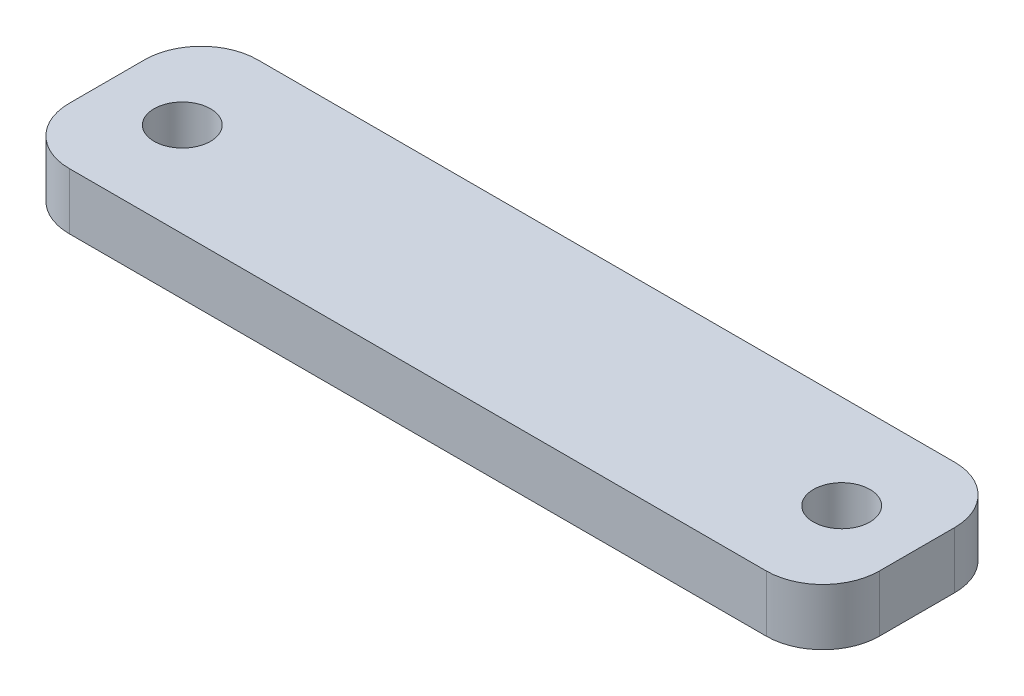
ISO-10303-21;
HEADER;
FILE_DESCRIPTION(('STEP AP214'),'2;1');
FILE_NAME('part.step','',(''),(''),'','','');
FILE_SCHEMA(('AUTOMOTIVE_DESIGN { 1 0 10303 214 1 1 1 1 }'));
ENDSEC;
DATA;
#1=APPLICATION_CONTEXT('core data for automotive mechanical design processes');
#2=APPLICATION_PROTOCOL_DEFINITION('international standard','automotive_design',2000,#1);
#3=PRODUCT_CONTEXT('',#1,'mechanical');
#4=PRODUCT('Part','Part','',(#3));
#5=PRODUCT_RELATED_PRODUCT_CATEGORY('part','',(#4));
#6=PRODUCT_DEFINITION_FORMATION('','',#4);
#7=PRODUCT_DEFINITION_CONTEXT('part definition',#1,'design');
#8=PRODUCT_DEFINITION('design','',#6,#7);
#9=PRODUCT_DEFINITION_SHAPE('','',#8);
#10=(LENGTH_UNIT() NAMED_UNIT(*) SI_UNIT(.MILLI.,.METRE.));
#11=(NAMED_UNIT(*) PLANE_ANGLE_UNIT() SI_UNIT($,.RADIAN.));
#12=(NAMED_UNIT(*) SI_UNIT($,.STERADIAN.) SOLID_ANGLE_UNIT());
#13=UNCERTAINTY_MEASURE_WITH_UNIT(LENGTH_MEASURE(1.E-05),#10,'distance_accuracy_value','');
#14=(GEOMETRIC_REPRESENTATION_CONTEXT(3) GLOBAL_UNCERTAINTY_ASSIGNED_CONTEXT((#13)) GLOBAL_UNIT_ASSIGNED_CONTEXT((#10,
#11,#12)) REPRESENTATION_CONTEXT('',''));
#15=CARTESIAN_POINT('',(0.,0.,0.));
#16=DIRECTION('',(0.,0.,1.));
#17=DIRECTION('',(1.,0.,0.));
#18=AXIS2_PLACEMENT_3D('',#15,#16,#17);
#19=CARTESIAN_POINT('',(0.,3.,0.));
#20=DIRECTION('',(0.,1.,0.));
#21=DIRECTION('',(0.,0.,1.));
#22=AXIS2_PLACEMENT_3D('',#19,#20,#21);
#23=PLANE('',#22);
#24=DIRECTION('',(0.,0.,1.));
#25=VECTOR('',#24,1.);
#26=CARTESIAN_POINT('',(-21.5,3.,-5.));
#27=LINE('',#26,#25);
#28=CARTESIAN_POINT('',(-21.5,3.,-2.));
#29=VERTEX_POINT('',#28);
#30=CARTESIAN_POINT('',(-21.5,3.,2.));
#31=VERTEX_POINT('',#30);
#32=EDGE_CURVE('E170',#29,#31,#27,.T.);
#33=ORIENTED_EDGE('',*,*,#32,.T.);
#34=CARTESIAN_POINT('',(-18.5,3.,2.));
#35=DIRECTION('',(0.,1.,0.));
#36=DIRECTION('',(0.,0.,1.));
#37=AXIS2_PLACEMENT_3D('',#34,#35,#36);
#38=CIRCLE('',#37,3.);
#39=CARTESIAN_POINT('',(-18.5,3.,5.));
#40=VERTEX_POINT('',#39);
#41=EDGE_CURVE('E147',#31,#40,#38,.T.);
#42=ORIENTED_EDGE('',*,*,#41,.T.);
#43=DIRECTION('',(1.,0.,0.));
#44=VECTOR('',#43,1.);
#45=CARTESIAN_POINT('',(-21.5,3.,5.));
#46=LINE('',#45,#44);
#47=CARTESIAN_POINT('',(18.5,3.,5.));
#48=VERTEX_POINT('',#47);
#49=EDGE_CURVE('E119',#40,#48,#46,.T.);
#50=ORIENTED_EDGE('',*,*,#49,.T.);
#51=CARTESIAN_POINT('',(18.5,3.,2.));
#52=DIRECTION('',(0.,1.,0.));
#53=DIRECTION('',(0.,0.,1.));
#54=AXIS2_PLACEMENT_3D('',#51,#52,#53);
#55=CIRCLE('',#54,3.);
#56=CARTESIAN_POINT('',(21.5,3.,2.));
#57=VERTEX_POINT('',#56);
#58=EDGE_CURVE('E143',#48,#57,#55,.T.);
#59=ORIENTED_EDGE('',*,*,#58,.T.);
#60=DIRECTION('',(0.,0.,-1.));
#61=VECTOR('',#60,1.);
#62=CARTESIAN_POINT('',(21.5,3.,-5.));
#63=LINE('',#62,#61);
#64=CARTESIAN_POINT('',(21.5,3.,-2.));
#65=VERTEX_POINT('',#64);
#66=EDGE_CURVE('E126',#57,#65,#63,.T.);
#67=ORIENTED_EDGE('',*,*,#66,.T.);
#68=CARTESIAN_POINT('',(18.5,3.,-2.));
#69=DIRECTION('',(0.,1.,0.));
#70=DIRECTION('',(0.,0.,1.));
#71=AXIS2_PLACEMENT_3D('',#68,#69,#70);
#72=CIRCLE('',#71,3.);
#73=CARTESIAN_POINT('',(18.5,3.,-5.));
#74=VERTEX_POINT('',#73);
#75=EDGE_CURVE('E54',#65,#74,#72,.T.);
#76=ORIENTED_EDGE('',*,*,#75,.T.);
#77=DIRECTION('',(-1.,0.,0.));
#78=VECTOR('',#77,1.);
#79=CARTESIAN_POINT('',(-21.5,3.,-5.));
#80=LINE('',#79,#78);
#81=CARTESIAN_POINT('',(-18.5,3.,-5.));
#82=VERTEX_POINT('',#81);
#83=EDGE_CURVE('E129',#74,#82,#80,.T.);
#84=ORIENTED_EDGE('',*,*,#83,.T.);
#85=CARTESIAN_POINT('',(-18.5,3.,-2.));
#86=DIRECTION('',(0.,1.,0.));
#87=DIRECTION('',(0.,0.,1.));
#88=AXIS2_PLACEMENT_3D('',#85,#86,#87);
#89=CIRCLE('',#88,3.);
#90=EDGE_CURVE('E145',#82,#29,#89,.T.);
#91=ORIENTED_EDGE('',*,*,#90,.T.);
#92=EDGE_LOOP('',(#33,#42,#50,#59,#67,#76,#84,#91));
#93=FACE_BOUND('',#92,.T.);
#94=CARTESIAN_POINT('',(-17.5,3.,0.));
#95=DIRECTION('',(0.,-1.,0.));
#96=DIRECTION('',(0.,0.,-1.));
#97=AXIS2_PLACEMENT_3D('',#94,#95,#96);
#98=CIRCLE('',#97,1.5);
#99=CARTESIAN_POINT('',(-17.5,3.,-1.5));
#100=VERTEX_POINT('',#99);
#101=EDGE_CURVE('E166',#100,#100,#98,.T.);
#102=ORIENTED_EDGE('',*,*,#101,.T.);
#103=EDGE_LOOP('',(#102));
#104=FACE_BOUND('',#103,.T.);
#105=CARTESIAN_POINT('',(17.5,3.,0.));
#106=DIRECTION('',(0.,-1.,0.));
#107=DIRECTION('',(0.,0.,-1.));
#108=AXIS2_PLACEMENT_3D('',#105,#106,#107);
#109=CIRCLE('',#108,1.5);
#110=CARTESIAN_POINT('',(17.5,3.,-1.49999999999999));
#111=VERTEX_POINT('',#110);
#112=EDGE_CURVE('E178',#111,#111,#109,.T.);
#113=ORIENTED_EDGE('',*,*,#112,.T.);
#114=EDGE_LOOP('',(#113));
#115=FACE_BOUND('',#114,.T.);
#116=ADVANCED_FACE('F32',(#93,#104,#115),#23,.T.);
#117=CARTESIAN_POINT('',(21.5,3.,-5.));
#118=DIRECTION('',(-1.,0.,0.));
#119=DIRECTION('',(0.,0.,1.));
#120=AXIS2_PLACEMENT_3D('',#117,#118,#119);
#121=PLANE('',#120);
#122=ORIENTED_EDGE('',*,*,#66,.F.);
#123=DIRECTION('',(0.,-1.,0.));
#124=VECTOR('',#123,1.);
#125=CARTESIAN_POINT('',(21.5,3.,2.));
#126=LINE('',#125,#124);
#127=CARTESIAN_POINT('',(21.5,0.,2.));
#128=VERTEX_POINT('',#127);
#129=EDGE_CURVE('E11',#57,#128,#126,.T.);
#130=ORIENTED_EDGE('',*,*,#129,.T.);
#131=DIRECTION('',(0.,0.,-1.));
#132=VECTOR('',#131,1.);
#133=CARTESIAN_POINT('',(21.5,0.,-5.));
#134=LINE('',#133,#132);
#135=CARTESIAN_POINT('',(21.5,0.,-2.));
#136=VERTEX_POINT('',#135);
#137=EDGE_CURVE('E158',#128,#136,#134,.T.);
#138=ORIENTED_EDGE('',*,*,#137,.T.);
#139=DIRECTION('',(0.,-1.,0.));
#140=VECTOR('',#139,1.);
#141=CARTESIAN_POINT('',(21.5,3.,-2.));
#142=LINE('',#141,#140);
#143=EDGE_CURVE('E40',#136,#65,#142,.F.);
#144=ORIENTED_EDGE('',*,*,#143,.T.);
#145=EDGE_LOOP('',(#122,#130,#138,#144));
#146=FACE_BOUND('',#145,.T.);
#147=ADVANCED_FACE('F156',(#146),#121,.F.);
#148=CARTESIAN_POINT('',(-21.5,3.,-5.));
#149=DIRECTION('',(0.,0.,1.));
#150=DIRECTION('',(1.,0.,0.));
#151=AXIS2_PLACEMENT_3D('',#148,#149,#150);
#152=PLANE('',#151);
#153=DIRECTION('',(-1.,0.,0.));
#154=VECTOR('',#153,1.);
#155=CARTESIAN_POINT('',(-21.5,0.,-5.));
#156=LINE('',#155,#154);
#157=CARTESIAN_POINT('',(18.5,0.,-5.));
#158=VERTEX_POINT('',#157);
#159=CARTESIAN_POINT('',(-18.5,0.,-5.));
#160=VERTEX_POINT('',#159);
#161=EDGE_CURVE('E131',#158,#160,#156,.T.);
#162=ORIENTED_EDGE('',*,*,#161,.T.);
#163=DIRECTION('',(0.,-1.,0.));
#164=VECTOR('',#163,1.);
#165=CARTESIAN_POINT('',(-18.5,3.,-5.));
#166=LINE('',#165,#164);
#167=EDGE_CURVE('E47',#160,#82,#166,.F.);
#168=ORIENTED_EDGE('',*,*,#167,.T.);
#169=ORIENTED_EDGE('',*,*,#83,.F.);
#170=DIRECTION('',(0.,-1.,0.));
#171=VECTOR('',#170,1.);
#172=CARTESIAN_POINT('',(18.5,3.,-5.));
#173=LINE('',#172,#171);
#174=EDGE_CURVE('E149',#74,#158,#173,.T.);
#175=ORIENTED_EDGE('',*,*,#174,.T.);
#176=EDGE_LOOP('',(#162,#168,#169,#175));
#177=FACE_BOUND('',#176,.T.);
#178=ADVANCED_FACE('F165',(#177),#152,.F.);
#179=CARTESIAN_POINT('',(-21.5,3.,-5.));
#180=DIRECTION('',(1.,0.,0.));
#181=DIRECTION('',(0.,0.,-1.));
#182=AXIS2_PLACEMENT_3D('',#179,#180,#181);
#183=PLANE('',#182);
#184=DIRECTION('',(0.,0.,1.));
#185=VECTOR('',#184,1.);
#186=CARTESIAN_POINT('',(-21.5,0.,-5.));
#187=LINE('',#186,#185);
#188=CARTESIAN_POINT('',(-21.5,0.,-2.));
#189=VERTEX_POINT('',#188);
#190=CARTESIAN_POINT('',(-21.5,0.,2.));
#191=VERTEX_POINT('',#190);
#192=EDGE_CURVE('E127',#189,#191,#187,.T.);
#193=ORIENTED_EDGE('',*,*,#192,.T.);
#194=DIRECTION('',(0.,-1.,0.));
#195=VECTOR('',#194,1.);
#196=CARTESIAN_POINT('',(-21.5,3.,2.));
#197=LINE('',#196,#195);
#198=EDGE_CURVE('E104',#191,#31,#197,.F.);
#199=ORIENTED_EDGE('',*,*,#198,.T.);
#200=ORIENTED_EDGE('',*,*,#32,.F.);
#201=DIRECTION('',(0.,-1.,0.));
#202=VECTOR('',#201,1.);
#203=CARTESIAN_POINT('',(-21.5,3.,-2.));
#204=LINE('',#203,#202);
#205=EDGE_CURVE('E109',#29,#189,#204,.T.);
#206=ORIENTED_EDGE('',*,*,#205,.T.);
#207=EDGE_LOOP('',(#193,#199,#200,#206));
#208=FACE_BOUND('',#207,.T.);
#209=ADVANCED_FACE('F213',(#208),#183,.F.);
#210=CARTESIAN_POINT('',(-21.5,3.,5.));
#211=DIRECTION('',(0.,0.,-1.));
#212=DIRECTION('',(-1.,0.,0.));
#213=AXIS2_PLACEMENT_3D('',#210,#211,#212);
#214=PLANE('',#213);
#215=ORIENTED_EDGE('',*,*,#49,.F.);
#216=DIRECTION('',(0.,-1.,0.));
#217=VECTOR('',#216,1.);
#218=CARTESIAN_POINT('',(-18.5,3.,5.));
#219=LINE('',#218,#217);
#220=CARTESIAN_POINT('',(-18.5,0.,5.));
#221=VERTEX_POINT('',#220);
#222=EDGE_CURVE('E103',#40,#221,#219,.T.);
#223=ORIENTED_EDGE('',*,*,#222,.T.);
#224=DIRECTION('',(1.,0.,0.));
#225=VECTOR('',#224,1.);
#226=CARTESIAN_POINT('',(-21.5,0.,5.));
#227=LINE('',#226,#225);
#228=CARTESIAN_POINT('',(18.5,0.,5.));
#229=VERTEX_POINT('',#228);
#230=EDGE_CURVE('E116',#221,#229,#227,.T.);
#231=ORIENTED_EDGE('',*,*,#230,.T.);
#232=DIRECTION('',(0.,-1.,0.));
#233=VECTOR('',#232,1.);
#234=CARTESIAN_POINT('',(18.5,3.,5.));
#235=LINE('',#234,#233);
#236=EDGE_CURVE('E121',#229,#48,#235,.F.);
#237=ORIENTED_EDGE('',*,*,#236,.T.);
#238=EDGE_LOOP('',(#215,#223,#231,#237));
#239=FACE_BOUND('',#238,.T.);
#240=ADVANCED_FACE('F115',(#239),#214,.F.);
#241=CARTESIAN_POINT('',(0.,0.,0.));
#242=DIRECTION('',(0.,1.,0.));
#243=DIRECTION('',(0.,0.,1.));
#244=AXIS2_PLACEMENT_3D('',#241,#242,#243);
#245=PLANE('',#244);
#246=CARTESIAN_POINT('',(17.5,0.,0.));
#247=DIRECTION('',(0.,-1.,0.));
#248=DIRECTION('',(0.,0.,-1.));
#249=AXIS2_PLACEMENT_3D('',#246,#247,#248);
#250=CIRCLE('',#249,1.49999999999999);
#251=CARTESIAN_POINT('',(17.5,0.,-1.49999999999998));
#252=VERTEX_POINT('',#251);
#253=EDGE_CURVE('E181',#252,#252,#250,.T.);
#254=ORIENTED_EDGE('',*,*,#253,.F.);
#255=EDGE_LOOP('',(#254));
#256=FACE_BOUND('',#255,.T.);
#257=CARTESIAN_POINT('',(-17.5,0.,0.));
#258=DIRECTION('',(0.,-1.,0.));
#259=DIRECTION('',(0.,0.,-1.));
#260=AXIS2_PLACEMENT_3D('',#257,#258,#259);
#261=CIRCLE('',#260,1.49999999999999);
#262=CARTESIAN_POINT('',(-17.5,0.,-1.49999999999999));
#263=VERTEX_POINT('',#262);
#264=EDGE_CURVE('E175',#263,#263,#261,.T.);
#265=ORIENTED_EDGE('',*,*,#264,.F.);
#266=EDGE_LOOP('',(#265));
#267=FACE_BOUND('',#266,.T.);
#268=ORIENTED_EDGE('',*,*,#230,.F.);
#269=CARTESIAN_POINT('',(-18.5,0.,2.));
#270=DIRECTION('',(0.,1.,0.));
#271=DIRECTION('',(0.,0.,1.));
#272=AXIS2_PLACEMENT_3D('',#269,#270,#271);
#273=CIRCLE('',#272,3.);
#274=EDGE_CURVE('E99',#221,#191,#273,.F.);
#275=ORIENTED_EDGE('',*,*,#274,.T.);
#276=ORIENTED_EDGE('',*,*,#192,.F.);
#277=CARTESIAN_POINT('',(-18.5,0.,-2.));
#278=DIRECTION('',(0.,1.,0.));
#279=DIRECTION('',(0.,0.,1.));
#280=AXIS2_PLACEMENT_3D('',#277,#278,#279);
#281=CIRCLE('',#280,3.);
#282=EDGE_CURVE('E110',#189,#160,#281,.F.);
#283=ORIENTED_EDGE('',*,*,#282,.T.);
#284=ORIENTED_EDGE('',*,*,#161,.F.);
#285=CARTESIAN_POINT('',(18.5,0.,-2.));
#286=DIRECTION('',(0.,1.,0.));
#287=DIRECTION('',(0.,0.,1.));
#288=AXIS2_PLACEMENT_3D('',#285,#286,#287);
#289=CIRCLE('',#288,3.);
#290=EDGE_CURVE('E120',#158,#136,#289,.F.);
#291=ORIENTED_EDGE('',*,*,#290,.T.);
#292=ORIENTED_EDGE('',*,*,#137,.F.);
#293=CARTESIAN_POINT('',(18.5,0.,2.));
#294=DIRECTION('',(0.,1.,0.));
#295=DIRECTION('',(0.,0.,1.));
#296=AXIS2_PLACEMENT_3D('',#293,#294,#295);
#297=CIRCLE('',#296,3.);
#298=EDGE_CURVE('E125',#128,#229,#297,.F.);
#299=ORIENTED_EDGE('',*,*,#298,.T.);
#300=EDGE_LOOP('',(#268,#275,#276,#283,#284,#291,#292,#299));
#301=FACE_BOUND('',#300,.T.);
#302=ADVANCED_FACE('F123',(#256,#267,#301),#245,.F.);
#303=CARTESIAN_POINT('',(-18.5,3.,2.));
#304=DIRECTION('',(0.,-1.,0.));
#305=DIRECTION('',(0.,0.,-1.));
#306=AXIS2_PLACEMENT_3D('',#303,#304,#305);
#307=CYLINDRICAL_SURFACE('',#306,3.);
#308=ORIENTED_EDGE('',*,*,#41,.F.);
#309=ORIENTED_EDGE('',*,*,#198,.F.);
#310=ORIENTED_EDGE('',*,*,#274,.F.);
#311=ORIENTED_EDGE('',*,*,#222,.F.);
#312=EDGE_LOOP('',(#308,#309,#310,#311));
#313=FACE_BOUND('',#312,.T.);
#314=ADVANCED_FACE('F102',(#313),#307,.T.);
#315=CARTESIAN_POINT('',(-18.5,3.,-2.));
#316=DIRECTION('',(0.,-1.,0.));
#317=DIRECTION('',(0.,0.,-1.));
#318=AXIS2_PLACEMENT_3D('',#315,#316,#317);
#319=CYLINDRICAL_SURFACE('',#318,3.);
#320=ORIENTED_EDGE('',*,*,#90,.F.);
#321=ORIENTED_EDGE('',*,*,#167,.F.);
#322=ORIENTED_EDGE('',*,*,#282,.F.);
#323=ORIENTED_EDGE('',*,*,#205,.F.);
#324=EDGE_LOOP('',(#320,#321,#322,#323));
#325=FACE_BOUND('',#324,.T.);
#326=ADVANCED_FACE('F221',(#325),#319,.T.);
#327=CARTESIAN_POINT('',(18.5,3.,2.));
#328=DIRECTION('',(0.,-1.,0.));
#329=DIRECTION('',(0.,0.,-1.));
#330=AXIS2_PLACEMENT_3D('',#327,#328,#329);
#331=CYLINDRICAL_SURFACE('',#330,3.);
#332=ORIENTED_EDGE('',*,*,#58,.F.);
#333=ORIENTED_EDGE('',*,*,#236,.F.);
#334=ORIENTED_EDGE('',*,*,#298,.F.);
#335=ORIENTED_EDGE('',*,*,#129,.F.);
#336=EDGE_LOOP('',(#332,#333,#334,#335));
#337=FACE_BOUND('',#336,.T.);
#338=ADVANCED_FACE('F202',(#337),#331,.T.);
#339=CARTESIAN_POINT('',(18.5,3.,-2.));
#340=DIRECTION('',(0.,-1.,0.));
#341=DIRECTION('',(0.,0.,-1.));
#342=AXIS2_PLACEMENT_3D('',#339,#340,#341);
#343=CYLINDRICAL_SURFACE('',#342,3.);
#344=ORIENTED_EDGE('',*,*,#75,.F.);
#345=ORIENTED_EDGE('',*,*,#143,.F.);
#346=ORIENTED_EDGE('',*,*,#290,.F.);
#347=ORIENTED_EDGE('',*,*,#174,.F.);
#348=EDGE_LOOP('',(#344,#345,#346,#347));
#349=FACE_BOUND('',#348,.T.);
#350=ADVANCED_FACE('F34',(#349),#343,.T.);
#351=CARTESIAN_POINT('',(-17.5,0.,0.));
#352=DIRECTION('',(0.,-1.,0.));
#353=DIRECTION('',(0.,0.,-1.));
#354=AXIS2_PLACEMENT_3D('',#351,#352,#353);
#355=CYLINDRICAL_SURFACE('',#354,1.49999999999999);
#356=ORIENTED_EDGE('',*,*,#101,.F.);
#357=EDGE_LOOP('',(#356));
#358=FACE_BOUND('',#357,.T.);
#359=ORIENTED_EDGE('',*,*,#264,.T.);
#360=EDGE_LOOP('',(#359));
#361=FACE_BOUND('',#360,.T.);
#362=ADVANCED_FACE('F192',(#358,#361),#355,.F.);
#363=CARTESIAN_POINT('',(17.5,0.,0.));
#364=DIRECTION('',(0.,-1.,0.));
#365=DIRECTION('',(0.,0.,-1.));
#366=AXIS2_PLACEMENT_3D('',#363,#364,#365);
#367=CYLINDRICAL_SURFACE('',#366,1.49999999999999);
#368=ORIENTED_EDGE('',*,*,#112,.F.);
#369=EDGE_LOOP('',(#368));
#370=FACE_BOUND('',#369,.T.);
#371=ORIENTED_EDGE('',*,*,#253,.T.);
#372=EDGE_LOOP('',(#371));
#373=FACE_BOUND('',#372,.T.);
#374=ADVANCED_FACE('F185',(#370,#373),#367,.F.);
#375=CLOSED_SHELL('',(#116,#147,#178,#209,#240,#302,#314,#326,#338,#350,#362,#374));
#376=MANIFOLD_SOLID_BREP('B2',#375);
#377=ADVANCED_BREP_SHAPE_REPRESENTATION('',(#18,#376),#14);
#378=SHAPE_DEFINITION_REPRESENTATION(#9,#377);
ENDSEC;
END-ISO-10303-21;
